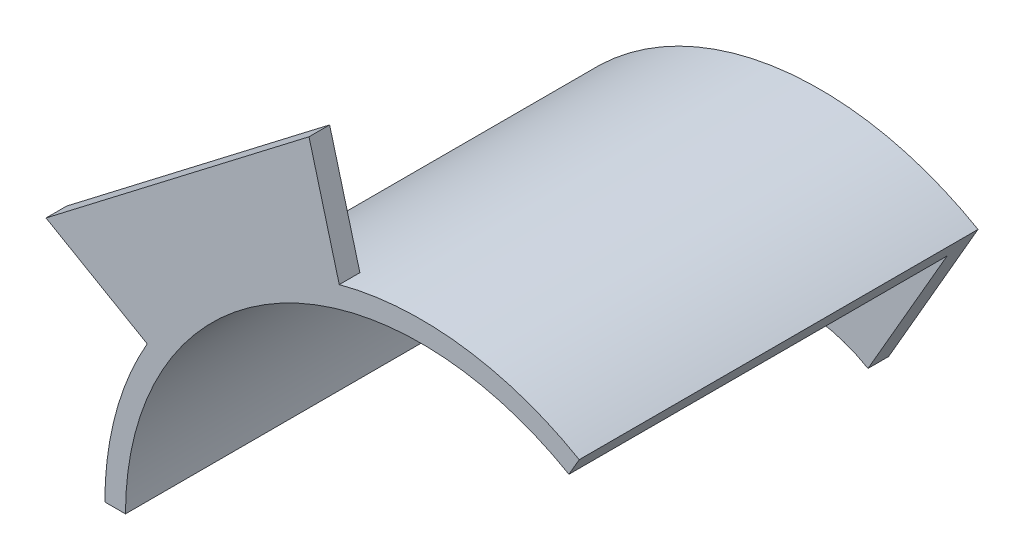
ISO-10303-21;
HEADER;
FILE_DESCRIPTION(('STEP AP214'),'2;1');
FILE_NAME('part.step','',(''),(''),'','','');
FILE_SCHEMA(('AUTOMOTIVE_DESIGN { 1 0 10303 214 1 1 1 1 }'));
ENDSEC;
DATA;
#1=APPLICATION_CONTEXT('core data for automotive mechanical design processes');
#2=APPLICATION_PROTOCOL_DEFINITION('international standard','automotive_design',2000,#1);
#3=PRODUCT_CONTEXT('',#1,'mechanical');
#4=PRODUCT('Part','Part','',(#3));
#5=PRODUCT_RELATED_PRODUCT_CATEGORY('part','',(#4));
#6=PRODUCT_DEFINITION_FORMATION('','',#4);
#7=PRODUCT_DEFINITION_CONTEXT('part definition',#1,'design');
#8=PRODUCT_DEFINITION('design','',#6,#7);
#9=PRODUCT_DEFINITION_SHAPE('','',#8);
#10=(LENGTH_UNIT() NAMED_UNIT(*) SI_UNIT(.MILLI.,.METRE.));
#11=(NAMED_UNIT(*) PLANE_ANGLE_UNIT() SI_UNIT($,.RADIAN.));
#12=(NAMED_UNIT(*) SI_UNIT($,.STERADIAN.) SOLID_ANGLE_UNIT());
#13=UNCERTAINTY_MEASURE_WITH_UNIT(LENGTH_MEASURE(1.E-05),#10,'distance_accuracy_value','');
#14=(GEOMETRIC_REPRESENTATION_CONTEXT(3) GLOBAL_UNCERTAINTY_ASSIGNED_CONTEXT((#13)) GLOBAL_UNIT_ASSIGNED_CONTEXT((#10,
#11,#12)) REPRESENTATION_CONTEXT('',''));
#15=CARTESIAN_POINT('',(0.,0.,0.));
#16=DIRECTION('',(0.,0.,1.));
#17=DIRECTION('',(1.,0.,0.));
#18=AXIS2_PLACEMENT_3D('',#15,#16,#17);
#19=CARTESIAN_POINT('',(0.,0.,55.));
#20=DIRECTION('',(0.,0.,1.));
#21=DIRECTION('',(1.,0.,0.));
#22=AXIS2_PLACEMENT_3D('',#19,#20,#21);
#23=PLANE('',#22);
#24=CARTESIAN_POINT('',(0.,0.,55.));
#25=DIRECTION('',(0.,0.,1.));
#26=DIRECTION('',(1.,0.,0.));
#27=AXIS2_PLACEMENT_3D('',#24,#25,#26);
#28=CIRCLE('',#27,46.);
#29=CARTESIAN_POINT('',(23.0000000000002,39.8371685740841,55.));
#30=VERTEX_POINT('',#29);
#31=CARTESIAN_POINT('',(-11.9056760747158,44.4325880092972,55.));
#32=VERTEX_POINT('',#31);
#33=EDGE_CURVE('E12',#30,#32,#28,.T.);
#34=ORIENTED_EDGE('',*,*,#33,.T.);
#35=DIRECTION('',(-0.258819045102517,0.965925826289069,0.));
#36=VECTOR('',#35,1.);
#37=CARTESIAN_POINT('',(-11.1292189394083,41.53481053043,55.));
#38=LINE('',#37,#36);
#39=CARTESIAN_POINT('',(-16.3055998414586,60.8533270562114,55.));
#40=VERTEX_POINT('',#39);
#41=EDGE_CURVE('E142',#32,#40,#38,.T.);
#42=ORIENTED_EDGE('',*,*,#41,.T.);
#43=DIRECTION('',(-0.793353340291236,-0.608761429008719,0.));
#44=VECTOR('',#43,1.);
#45=CARTESIAN_POINT('',(-54.5596004384196,31.5,55.));
#46=LINE('',#45,#44);
#47=CARTESIAN_POINT('',(-54.5596004384196,31.5,55.));
#48=VERTEX_POINT('',#47);
#49=EDGE_CURVE('E133',#40,#48,#46,.T.);
#50=ORIENTED_EDGE('',*,*,#49,.T.);
#51=DIRECTION('',(0.866025403784438,-0.500000000000001,0.));
#52=VECTOR('',#51,1.);
#53=CARTESIAN_POINT('',(-37.2390923627308,21.5,55.));
#54=LINE('',#53,#52);
#55=CARTESIAN_POINT('',(-39.8371685740841,23.,55.));
#56=VERTEX_POINT('',#55);
#57=EDGE_CURVE('E54',#48,#56,#54,.T.);
#58=ORIENTED_EDGE('',*,*,#57,.T.);
#59=CARTESIAN_POINT('',(-46.,0.,55.));
#60=VERTEX_POINT('',#59);
#61=EDGE_CURVE('E47',#56,#60,#28,.T.);
#62=ORIENTED_EDGE('',*,*,#61,.T.);
#63=DIRECTION('',(1.,0.,0.));
#64=VECTOR('',#63,1.);
#65=CARTESIAN_POINT('',(-43.,0.,55.));
#66=LINE('',#65,#64);
#67=CARTESIAN_POINT('',(-43.,0.,55.));
#68=VERTEX_POINT('',#67);
#69=EDGE_CURVE('E153',#60,#68,#66,.T.);
#70=ORIENTED_EDGE('',*,*,#69,.T.);
#71=CARTESIAN_POINT('',(0.,0.,55.));
#72=DIRECTION('',(0.,0.,1.));
#73=DIRECTION('',(1.,0.,0.));
#74=AXIS2_PLACEMENT_3D('',#71,#72,#73);
#75=CIRCLE('',#74,43.);
#76=CARTESIAN_POINT('',(21.5000000000002,37.2390923627308,55.));
#77=VERTEX_POINT('',#76);
#78=EDGE_CURVE('E189',#77,#68,#75,.T.);
#79=ORIENTED_EDGE('',*,*,#78,.F.);
#80=DIRECTION('',(0.500000000000004,0.866025403784436,0.));
#81=VECTOR('',#80,1.);
#82=CARTESIAN_POINT('',(23.0000000000002,39.8371685740841,55.));
#83=LINE('',#82,#81);
#84=EDGE_CURVE('E62',#77,#30,#83,.T.);
#85=ORIENTED_EDGE('',*,*,#84,.T.);
#86=EDGE_LOOP('',(#34,#42,#50,#58,#62,#70,#79,#85));
#87=FACE_BOUND('',#86,.T.);
#88=ADVANCED_FACE('F39',(#87),#23,.T.);
#89=CARTESIAN_POINT('',(0.,0.,55.));
#90=DIRECTION('',(0.,0.,-1.));
#91=DIRECTION('',(-1.,0.,0.));
#92=AXIS2_PLACEMENT_3D('',#89,#90,#91);
#93=CYLINDRICAL_SURFACE('',#92,46.);
#94=ORIENTED_EDGE('',*,*,#61,.F.);
#95=DIRECTION('',(0.,0.,-1.));
#96=VECTOR('',#95,1.);
#97=CARTESIAN_POINT('',(-39.8371685740842,23.,55.));
#98=LINE('',#97,#96);
#99=CARTESIAN_POINT('',(-39.8371685740841,23.,52.));
#100=VERTEX_POINT('',#99);
#101=EDGE_CURVE('E150',#56,#100,#98,.T.);
#102=ORIENTED_EDGE('',*,*,#101,.T.);
#103=CARTESIAN_POINT('',(0.,0.,52.));
#104=DIRECTION('',(0.,0.,-1.));
#105=DIRECTION('',(-1.,0.,0.));
#106=AXIS2_PLACEMENT_3D('',#103,#104,#105);
#107=CIRCLE('',#106,46.);
#108=CARTESIAN_POINT('',(-11.9056760747158,44.4325880092972,52.));
#109=VERTEX_POINT('',#108);
#110=EDGE_CURVE('E146',#100,#109,#107,.T.);
#111=ORIENTED_EDGE('',*,*,#110,.T.);
#112=DIRECTION('',(0.,0.,-1.));
#113=VECTOR('',#112,1.);
#114=CARTESIAN_POINT('',(-11.9056760747158,44.4325880092972,55.));
#115=LINE('',#114,#113);
#116=EDGE_CURVE('E123',#109,#32,#115,.F.);
#117=ORIENTED_EDGE('',*,*,#116,.T.);
#118=ORIENTED_EDGE('',*,*,#33,.F.);
#119=DIRECTION('',(0.,0.,1.));
#120=VECTOR('',#119,1.);
#121=CARTESIAN_POINT('',(23.0000000000002,39.8371685740841,-3.));
#122=LINE('',#121,#120);
#123=CARTESIAN_POINT('',(23.0000000000002,39.8371685740841,-3.));
#124=VERTEX_POINT('',#123);
#125=EDGE_CURVE('E186',#124,#30,#122,.T.);
#126=ORIENTED_EDGE('',*,*,#125,.F.);
#127=CARTESIAN_POINT('',(0.,0.,-3.));
#128=DIRECTION('',(0.,0.,-1.));
#129=DIRECTION('',(1.,0.,0.));
#130=AXIS2_PLACEMENT_3D('',#127,#128,#129);
#131=CIRCLE('',#130,46.);
#132=CARTESIAN_POINT('',(-46.,0.,-3.));
#133=VERTEX_POINT('',#132);
#134=EDGE_CURVE('E162',#133,#124,#131,.T.);
#135=ORIENTED_EDGE('',*,*,#134,.F.);
#136=DIRECTION('',(0.,0.,1.));
#137=VECTOR('',#136,1.);
#138=CARTESIAN_POINT('',(-46.,0.,-3.));
#139=LINE('',#138,#137);
#140=EDGE_CURVE('E172',#133,#60,#139,.T.);
#141=ORIENTED_EDGE('',*,*,#140,.T.);
#142=EDGE_LOOP('',(#94,#102,#111,#117,#118,#126,#135,#141));
#143=FACE_BOUND('',#142,.T.);
#144=ADVANCED_FACE('F41',(#143),#93,.T.);
#145=CARTESIAN_POINT('',(0.,0.,55.));
#146=DIRECTION('',(0.,0.,-1.));
#147=DIRECTION('',(-1.,0.,0.));
#148=AXIS2_PLACEMENT_3D('',#145,#146,#147);
#149=CYLINDRICAL_SURFACE('',#148,43.);
#150=ORIENTED_EDGE('',*,*,#78,.T.);
#151=DIRECTION('',(0.,0.,-1.));
#152=VECTOR('',#151,1.);
#153=CARTESIAN_POINT('',(-43.,0.,180.82535320362));
#154=LINE('',#153,#152);
#155=CARTESIAN_POINT('',(-43.,0.,0.));
#156=VERTEX_POINT('',#155);
#157=EDGE_CURVE('E156',#68,#156,#154,.T.);
#158=ORIENTED_EDGE('',*,*,#157,.T.);
#159=CARTESIAN_POINT('',(0.,0.,0.));
#160=DIRECTION('',(0.,0.,1.));
#161=DIRECTION('',(1.,0.,0.));
#162=AXIS2_PLACEMENT_3D('',#159,#160,#161);
#163=CIRCLE('',#162,43.);
#164=CARTESIAN_POINT('',(21.5000000000002,37.2390923627308,0.));
#165=VERTEX_POINT('',#164);
#166=EDGE_CURVE('E188',#165,#156,#163,.T.);
#167=ORIENTED_EDGE('',*,*,#166,.F.);
#168=DIRECTION('',(0.,0.,-1.));
#169=VECTOR('',#168,1.);
#170=CARTESIAN_POINT('',(21.5000000000002,37.2390923627308,180.82535320362));
#171=LINE('',#170,#169);
#172=EDGE_CURVE('E159',#77,#165,#171,.T.);
#173=ORIENTED_EDGE('',*,*,#172,.F.);
#174=EDGE_LOOP('',(#150,#158,#167,#173));
#175=FACE_BOUND('',#174,.T.);
#176=ADVANCED_FACE('F211',(#175),#149,.F.);
#177=CARTESIAN_POINT('',(10.0000000000001,17.3205080756887,-3.));
#178=DIRECTION('',(-0.866025403784436,0.500000000000004,0.));
#179=DIRECTION('',(-0.500000000000004,-0.866025403784436,0.));
#180=AXIS2_PLACEMENT_3D('',#177,#178,#179);
#181=PLANE('',#180);
#182=DIRECTION('',(0.,0.,1.));
#183=VECTOR('',#182,1.);
#184=CARTESIAN_POINT('',(10.0000000000001,17.3205080756887,-3.));
#185=LINE('',#184,#183);
#186=CARTESIAN_POINT('',(10.0000000000001,17.3205080756887,-3.));
#187=VERTEX_POINT('',#186);
#188=CARTESIAN_POINT('',(10.0000000000001,17.3205080756887,0.));
#189=VERTEX_POINT('',#188);
#190=EDGE_CURVE('E183',#187,#189,#185,.T.);
#191=ORIENTED_EDGE('',*,*,#190,.F.);
#192=DIRECTION('',(-0.500000000000004,-0.866025403784436,0.));
#193=VECTOR('',#192,1.);
#194=CARTESIAN_POINT('',(10.0000000000001,17.3205080756887,-3.));
#195=LINE('',#194,#193);
#196=EDGE_CURVE('E165',#124,#187,#195,.T.);
#197=ORIENTED_EDGE('',*,*,#196,.F.);
#198=ORIENTED_EDGE('',*,*,#125,.T.);
#199=ORIENTED_EDGE('',*,*,#84,.F.);
#200=ORIENTED_EDGE('',*,*,#172,.T.);
#201=DIRECTION('',(-0.500000000000004,-0.866025403784436,0.));
#202=VECTOR('',#201,1.);
#203=CARTESIAN_POINT('',(10.0000000000001,17.3205080756887,0.));
#204=LINE('',#203,#202);
#205=EDGE_CURVE('E158',#165,#189,#204,.T.);
#206=ORIENTED_EDGE('',*,*,#205,.T.);
#207=EDGE_LOOP('',(#191,#197,#198,#199,#200,#206));
#208=FACE_BOUND('',#207,.T.);
#209=ADVANCED_FACE('F209',(#208),#181,.F.);
#210=CARTESIAN_POINT('',(0.,0.,-3.));
#211=DIRECTION('',(0.,0.,1.));
#212=DIRECTION('',(1.,0.,0.));
#213=AXIS2_PLACEMENT_3D('',#210,#211,#212);
#214=CYLINDRICAL_SURFACE('',#213,20.);
#215=CARTESIAN_POINT('',(0.,0.,0.));
#216=DIRECTION('',(0.,0.,1.));
#217=DIRECTION('',(-1.,0.,0.));
#218=AXIS2_PLACEMENT_3D('',#215,#216,#217);
#219=CIRCLE('',#218,20.);
#220=CARTESIAN_POINT('',(-20.,0.,0.));
#221=VERTEX_POINT('',#220);
#222=EDGE_CURVE('E174',#189,#221,#219,.T.);
#223=ORIENTED_EDGE('',*,*,#222,.T.);
#224=DIRECTION('',(0.,0.,1.));
#225=VECTOR('',#224,1.);
#226=CARTESIAN_POINT('',(-20.,0.,-3.));
#227=LINE('',#226,#225);
#228=CARTESIAN_POINT('',(-20.,0.,-3.));
#229=VERTEX_POINT('',#228);
#230=EDGE_CURVE('E180',#229,#221,#227,.T.);
#231=ORIENTED_EDGE('',*,*,#230,.F.);
#232=CARTESIAN_POINT('',(0.,0.,-3.));
#233=DIRECTION('',(0.,0.,1.));
#234=DIRECTION('',(-1.,0.,0.));
#235=AXIS2_PLACEMENT_3D('',#232,#233,#234);
#236=CIRCLE('',#235,20.);
#237=EDGE_CURVE('E168',#187,#229,#236,.T.);
#238=ORIENTED_EDGE('',*,*,#237,.F.);
#239=ORIENTED_EDGE('',*,*,#190,.T.);
#240=EDGE_LOOP('',(#223,#231,#238,#239));
#241=FACE_BOUND('',#240,.T.);
#242=ADVANCED_FACE('F207',(#241),#214,.F.);
#243=CARTESIAN_POINT('',(-46.,0.,-3.));
#244=DIRECTION('',(0.,1.,0.));
#245=DIRECTION('',(0.,0.,1.));
#246=AXIS2_PLACEMENT_3D('',#243,#244,#245);
#247=PLANE('',#246);
#248=DIRECTION('',(-1.,0.,0.));
#249=VECTOR('',#248,1.);
#250=CARTESIAN_POINT('',(-46.,0.,0.));
#251=LINE('',#250,#249);
#252=EDGE_CURVE('E166',#221,#156,#251,.T.);
#253=ORIENTED_EDGE('',*,*,#252,.T.);
#254=ORIENTED_EDGE('',*,*,#157,.F.);
#255=ORIENTED_EDGE('',*,*,#69,.F.);
#256=ORIENTED_EDGE('',*,*,#140,.F.);
#257=DIRECTION('',(-1.,0.,0.));
#258=VECTOR('',#257,1.);
#259=CARTESIAN_POINT('',(-46.,0.,-3.));
#260=LINE('',#259,#258);
#261=EDGE_CURVE('E170',#229,#133,#260,.T.);
#262=ORIENTED_EDGE('',*,*,#261,.F.);
#263=ORIENTED_EDGE('',*,*,#230,.T.);
#264=EDGE_LOOP('',(#253,#254,#255,#256,#262,#263));
#265=FACE_BOUND('',#264,.T.);
#266=ADVANCED_FACE('F200',(#265),#247,.F.);
#267=CARTESIAN_POINT('',(0.,0.,-3.));
#268=DIRECTION('',(0.,0.,1.));
#269=DIRECTION('',(1.,0.,0.));
#270=AXIS2_PLACEMENT_3D('',#267,#268,#269);
#271=PLANE('',#270);
#272=ORIENTED_EDGE('',*,*,#134,.T.);
#273=ORIENTED_EDGE('',*,*,#196,.T.);
#274=ORIENTED_EDGE('',*,*,#237,.T.);
#275=ORIENTED_EDGE('',*,*,#261,.T.);
#276=EDGE_LOOP('',(#272,#273,#274,#275));
#277=FACE_BOUND('',#276,.T.);
#278=ADVANCED_FACE('F218',(#277),#271,.F.);
#279=CARTESIAN_POINT('',(0.,0.,0.));
#280=DIRECTION('',(0.,0.,1.));
#281=DIRECTION('',(1.,0.,0.));
#282=AXIS2_PLACEMENT_3D('',#279,#280,#281);
#283=PLANE('',#282);
#284=ORIENTED_EDGE('',*,*,#205,.F.);
#285=ORIENTED_EDGE('',*,*,#166,.T.);
#286=ORIENTED_EDGE('',*,*,#252,.F.);
#287=ORIENTED_EDGE('',*,*,#222,.F.);
#288=EDGE_LOOP('',(#284,#285,#286,#287));
#289=FACE_BOUND('',#288,.T.);
#290=ADVANCED_FACE('F195',(#289),#283,.T.);
#291=CARTESIAN_POINT('',(-37.2390923627308,21.5,52.));
#292=DIRECTION('',(-0.500000000000001,-0.866025403784438,0.));
#293=DIRECTION('',(0.866025403784438,-0.500000000000001,0.));
#294=AXIS2_PLACEMENT_3D('',#291,#292,#293);
#295=PLANE('',#294);
#296=ORIENTED_EDGE('',*,*,#101,.F.);
#297=ORIENTED_EDGE('',*,*,#57,.F.);
#298=DIRECTION('',(0.,0.,1.));
#299=VECTOR('',#298,1.);
#300=CARTESIAN_POINT('',(-54.5596004384196,31.5,52.));
#301=LINE('',#300,#299);
#302=CARTESIAN_POINT('',(-54.5596004384196,31.5,52.));
#303=VERTEX_POINT('',#302);
#304=EDGE_CURVE('E134',#303,#48,#301,.T.);
#305=ORIENTED_EDGE('',*,*,#304,.F.);
#306=DIRECTION('',(0.866025403784438,-0.500000000000001,0.));
#307=VECTOR('',#306,1.);
#308=CARTESIAN_POINT('',(-37.2390923627308,21.5,52.));
#309=LINE('',#308,#307);
#310=EDGE_CURVE('E135',#303,#100,#309,.T.);
#311=ORIENTED_EDGE('',*,*,#310,.T.);
#312=EDGE_LOOP('',(#296,#297,#305,#311));
#313=FACE_BOUND('',#312,.T.);
#314=ADVANCED_FACE('F225',(#313),#295,.T.);
#315=CARTESIAN_POINT('',(-11.1292189394083,41.53481053043,52.));
#316=DIRECTION('',(0.965925826289069,0.258819045102517,0.));
#317=DIRECTION('',(-0.258819045102517,0.965925826289069,0.));
#318=AXIS2_PLACEMENT_3D('',#315,#316,#317);
#319=PLANE('',#318);
#320=ORIENTED_EDGE('',*,*,#116,.F.);
#321=DIRECTION('',(-0.258819045102517,0.965925826289069,0.));
#322=VECTOR('',#321,1.);
#323=CARTESIAN_POINT('',(-11.1292189394083,41.53481053043,52.));
#324=LINE('',#323,#322);
#325=CARTESIAN_POINT('',(-16.3055998414586,60.8533270562114,52.));
#326=VERTEX_POINT('',#325);
#327=EDGE_CURVE('E117',#109,#326,#324,.T.);
#328=ORIENTED_EDGE('',*,*,#327,.T.);
#329=DIRECTION('',(0.,0.,1.));
#330=VECTOR('',#329,1.);
#331=CARTESIAN_POINT('',(-16.3055998414586,60.8533270562114,52.));
#332=LINE('',#331,#330);
#333=EDGE_CURVE('E120',#326,#40,#332,.T.);
#334=ORIENTED_EDGE('',*,*,#333,.T.);
#335=ORIENTED_EDGE('',*,*,#41,.F.);
#336=EDGE_LOOP('',(#320,#328,#334,#335));
#337=FACE_BOUND('',#336,.T.);
#338=ADVANCED_FACE('F119',(#337),#319,.T.);
#339=CARTESIAN_POINT('',(2.74086309204336E-13,-3.33066907387547E-13,52.));
#340=DIRECTION('',(0.,0.,-1.));
#341=DIRECTION('',(-1.,0.,0.));
#342=AXIS2_PLACEMENT_3D('',#339,#340,#341);
#343=PLANE('',#342);
#344=ORIENTED_EDGE('',*,*,#110,.F.);
#345=ORIENTED_EDGE('',*,*,#310,.F.);
#346=DIRECTION('',(-0.793353340291236,-0.608761429008719,0.));
#347=VECTOR('',#346,1.);
#348=CARTESIAN_POINT('',(-54.5596004384196,31.5,52.));
#349=LINE('',#348,#347);
#350=EDGE_CURVE('E127',#326,#303,#349,.T.);
#351=ORIENTED_EDGE('',*,*,#350,.F.);
#352=ORIENTED_EDGE('',*,*,#327,.F.);
#353=EDGE_LOOP('',(#344,#345,#351,#352));
#354=FACE_BOUND('',#353,.T.);
#355=ADVANCED_FACE('F137',(#354),#343,.T.);
#356=CARTESIAN_POINT('',(-54.5596004384196,31.5,52.));
#357=DIRECTION('',(-0.608761429008719,0.793353340291236,0.));
#358=DIRECTION('',(-0.793353340291236,-0.608761429008719,0.));
#359=AXIS2_PLACEMENT_3D('',#356,#357,#358);
#360=PLANE('',#359);
#361=ORIENTED_EDGE('',*,*,#49,.F.);
#362=ORIENTED_EDGE('',*,*,#333,.F.);
#363=ORIENTED_EDGE('',*,*,#350,.T.);
#364=ORIENTED_EDGE('',*,*,#304,.T.);
#365=EDGE_LOOP('',(#361,#362,#363,#364));
#366=FACE_BOUND('',#365,.T.);
#367=ADVANCED_FACE('F131',(#366),#360,.T.);
#368=CLOSED_SHELL('',(#88,#144,#176,#209,#242,#266,#278,#290,#314,#338,#355,#367));
#369=MANIFOLD_SOLID_BREP('B2',#368);
#370=ADVANCED_BREP_SHAPE_REPRESENTATION('',(#18,#369),#14);
#371=SHAPE_DEFINITION_REPRESENTATION(#9,#370);
ENDSEC;
END-ISO-10303-21;
